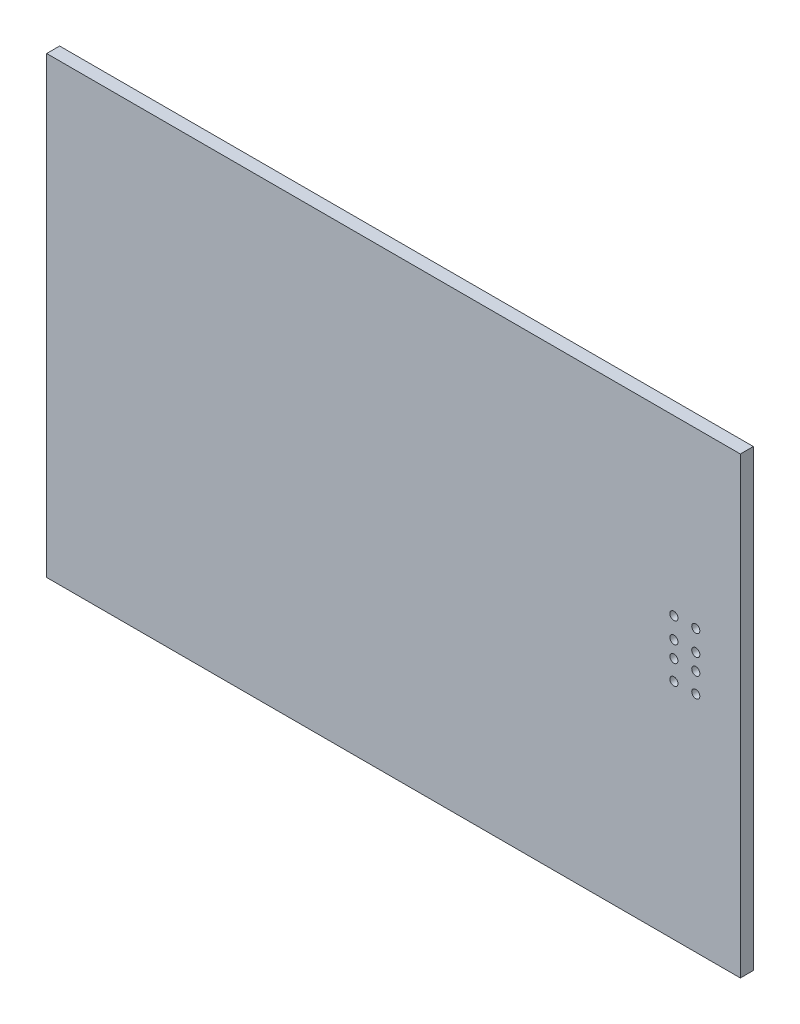
ISO-10303-21;
HEADER;
FILE_DESCRIPTION(('STEP AP214'),'2;1');
FILE_NAME('part.step','',(''),(''),'','','');
FILE_SCHEMA(('AUTOMOTIVE_DESIGN { 1 0 10303 214 1 1 1 1 }'));
ENDSEC;
DATA;
#1=APPLICATION_CONTEXT('core data for automotive mechanical design processes');
#2=APPLICATION_PROTOCOL_DEFINITION('international standard','automotive_design',2000,#1);
#3=PRODUCT_CONTEXT('',#1,'mechanical');
#4=PRODUCT('Part','Part','',(#3));
#5=PRODUCT_RELATED_PRODUCT_CATEGORY('part','',(#4));
#6=PRODUCT_DEFINITION_FORMATION('','',#4);
#7=PRODUCT_DEFINITION_CONTEXT('part definition',#1,'design');
#8=PRODUCT_DEFINITION('design','',#6,#7);
#9=PRODUCT_DEFINITION_SHAPE('','',#8);
#10=(LENGTH_UNIT() NAMED_UNIT(*) SI_UNIT(.MILLI.,.METRE.));
#11=(NAMED_UNIT(*) PLANE_ANGLE_UNIT() SI_UNIT($,.RADIAN.));
#12=(NAMED_UNIT(*) SI_UNIT($,.STERADIAN.) SOLID_ANGLE_UNIT());
#13=UNCERTAINTY_MEASURE_WITH_UNIT(LENGTH_MEASURE(1.E-05),#10,'distance_accuracy_value','');
#14=(GEOMETRIC_REPRESENTATION_CONTEXT(3) GLOBAL_UNCERTAINTY_ASSIGNED_CONTEXT((#13)) GLOBAL_UNIT_ASSIGNED_CONTEXT((#10,
#11,#12)) REPRESENTATION_CONTEXT('',''));
#15=CARTESIAN_POINT('',(0.,0.,0.));
#16=DIRECTION('',(0.,0.,1.));
#17=DIRECTION('',(1.,0.,0.));
#18=AXIS2_PLACEMENT_3D('',#15,#16,#17);
#19=CARTESIAN_POINT('',(-43.1,28.,1.6));
#20=DIRECTION('',(0.,1.,0.));
#21=DIRECTION('',(-1.,0.,0.));
#22=AXIS2_PLACEMENT_3D('',#19,#20,#21);
#23=PLANE('',#22);
#24=DIRECTION('',(1.,0.,0.));
#25=VECTOR('',#24,1.);
#26=CARTESIAN_POINT('',(-43.1,28.,0.));
#27=LINE('',#26,#25);
#28=CARTESIAN_POINT('',(-43.1,28.,0.));
#29=VERTEX_POINT('',#28);
#30=CARTESIAN_POINT('',(42.5,28.,0.));
#31=VERTEX_POINT('',#30);
#32=EDGE_CURVE('E99',#29,#31,#27,.T.);
#33=ORIENTED_EDGE('',*,*,#32,.F.);
#34=DIRECTION('',(0.,0.,-1.));
#35=VECTOR('',#34,1.);
#36=CARTESIAN_POINT('',(-43.1,28.,1.6));
#37=LINE('',#36,#35);
#38=CARTESIAN_POINT('',(-43.1,28.,1.6));
#39=VERTEX_POINT('',#38);
#40=EDGE_CURVE('E11',#39,#29,#37,.T.);
#41=ORIENTED_EDGE('',*,*,#40,.F.);
#42=DIRECTION('',(1.,0.,0.));
#43=VECTOR('',#42,1.);
#44=CARTESIAN_POINT('',(-43.1,28.,1.6));
#45=LINE('',#44,#43);
#46=CARTESIAN_POINT('',(42.5,28.,1.6));
#47=VERTEX_POINT('',#46);
#48=EDGE_CURVE('E92',#39,#47,#45,.T.);
#49=ORIENTED_EDGE('',*,*,#48,.T.);
#50=DIRECTION('',(0.,0.,-1.));
#51=VECTOR('',#50,1.);
#52=CARTESIAN_POINT('',(42.5,28.,1.6));
#53=LINE('',#52,#51);
#54=EDGE_CURVE('E75',#47,#31,#53,.T.);
#55=ORIENTED_EDGE('',*,*,#54,.T.);
#56=EDGE_LOOP('',(#33,#41,#49,#55));
#57=FACE_BOUND('',#56,.T.);
#58=ADVANCED_FACE('F32',(#57),#23,.T.);
#59=CARTESIAN_POINT('',(-43.1,-28.,1.6));
#60=DIRECTION('',(-1.,0.,0.));
#61=DIRECTION('',(0.,-1.,0.));
#62=AXIS2_PLACEMENT_3D('',#59,#60,#61);
#63=PLANE('',#62);
#64=DIRECTION('',(0.,1.,0.));
#65=VECTOR('',#64,1.);
#66=CARTESIAN_POINT('',(-43.1,-28.,0.));
#67=LINE('',#66,#65);
#68=CARTESIAN_POINT('',(-43.1,-28.,0.));
#69=VERTEX_POINT('',#68);
#70=EDGE_CURVE('E94',#69,#29,#67,.T.);
#71=ORIENTED_EDGE('',*,*,#70,.F.);
#72=DIRECTION('',(0.,0.,-1.));
#73=VECTOR('',#72,1.);
#74=CARTESIAN_POINT('',(-43.1,-28.,1.6));
#75=LINE('',#74,#73);
#76=CARTESIAN_POINT('',(-43.1,-28.,1.6));
#77=VERTEX_POINT('',#76);
#78=EDGE_CURVE('E41',#77,#69,#75,.T.);
#79=ORIENTED_EDGE('',*,*,#78,.F.);
#80=DIRECTION('',(0.,1.,0.));
#81=VECTOR('',#80,1.);
#82=CARTESIAN_POINT('',(-43.1,-28.,1.6));
#83=LINE('',#82,#81);
#84=EDGE_CURVE('E89',#77,#39,#83,.T.);
#85=ORIENTED_EDGE('',*,*,#84,.T.);
#86=ORIENTED_EDGE('',*,*,#40,.T.);
#87=EDGE_LOOP('',(#71,#79,#85,#86));
#88=FACE_BOUND('',#87,.T.);
#89=ADVANCED_FACE('F173',(#88),#63,.T.);
#90=CARTESIAN_POINT('',(42.5,-28.,1.6));
#91=DIRECTION('',(0.,-1.,0.));
#92=DIRECTION('',(0.,0.,-1.));
#93=AXIS2_PLACEMENT_3D('',#90,#91,#92);
#94=PLANE('',#93);
#95=DIRECTION('',(-1.,0.,0.));
#96=VECTOR('',#95,1.);
#97=CARTESIAN_POINT('',(42.5,-28.,0.));
#98=LINE('',#97,#96);
#99=CARTESIAN_POINT('',(42.5,-28.,0.));
#100=VERTEX_POINT('',#99);
#101=EDGE_CURVE('E83',#100,#69,#98,.T.);
#102=ORIENTED_EDGE('',*,*,#101,.F.);
#103=DIRECTION('',(0.,0.,-1.));
#104=VECTOR('',#103,1.);
#105=CARTESIAN_POINT('',(42.5,-28.,1.6));
#106=LINE('',#105,#104);
#107=CARTESIAN_POINT('',(42.5,-28.,1.6));
#108=VERTEX_POINT('',#107);
#109=EDGE_CURVE('E78',#108,#100,#106,.T.);
#110=ORIENTED_EDGE('',*,*,#109,.F.);
#111=DIRECTION('',(-1.,0.,0.));
#112=VECTOR('',#111,1.);
#113=CARTESIAN_POINT('',(42.5,-28.,1.6));
#114=LINE('',#113,#112);
#115=EDGE_CURVE('E81',#108,#77,#114,.T.);
#116=ORIENTED_EDGE('',*,*,#115,.T.);
#117=ORIENTED_EDGE('',*,*,#78,.T.);
#118=EDGE_LOOP('',(#102,#110,#116,#117));
#119=FACE_BOUND('',#118,.T.);
#120=ADVANCED_FACE('F80',(#119),#94,.T.);
#121=CARTESIAN_POINT('',(42.5,28.,1.6));
#122=DIRECTION('',(1.,0.,0.));
#123=DIRECTION('',(0.,0.,-1.));
#124=AXIS2_PLACEMENT_3D('',#121,#122,#123);
#125=PLANE('',#124);
#126=DIRECTION('',(0.,-1.,0.));
#127=VECTOR('',#126,1.);
#128=CARTESIAN_POINT('',(42.5,28.,0.));
#129=LINE('',#128,#127);
#130=EDGE_CURVE('E102',#31,#100,#129,.T.);
#131=ORIENTED_EDGE('',*,*,#130,.F.);
#132=ORIENTED_EDGE('',*,*,#54,.F.);
#133=DIRECTION('',(0.,-1.,0.));
#134=VECTOR('',#133,1.);
#135=CARTESIAN_POINT('',(42.5,28.,1.6));
#136=LINE('',#135,#134);
#137=EDGE_CURVE('E88',#47,#108,#136,.T.);
#138=ORIENTED_EDGE('',*,*,#137,.T.);
#139=ORIENTED_EDGE('',*,*,#109,.T.);
#140=EDGE_LOOP('',(#131,#132,#138,#139));
#141=FACE_BOUND('',#140,.T.);
#142=ADVANCED_FACE('F91',(#141),#125,.T.);
#143=CARTESIAN_POINT('',(0.,0.,1.6));
#144=DIRECTION('',(0.,0.,-1.));
#145=DIRECTION('',(-1.,0.,0.));
#146=AXIS2_PLACEMENT_3D('',#143,#144,#145);
#147=PLANE('',#146);
#148=CARTESIAN_POINT('',(37.,-0.4,1.6));
#149=DIRECTION('',(0.,0.,1.));
#150=DIRECTION('',(1.,0.,0.));
#151=AXIS2_PLACEMENT_3D('',#148,#149,#150);
#152=CIRCLE('',#151,0.499999999999999);
#153=CARTESIAN_POINT('',(37.5,-0.4,1.6));
#154=VERTEX_POINT('',#153);
#155=EDGE_CURVE('E144',#154,#154,#152,.T.);
#156=ORIENTED_EDGE('',*,*,#155,.F.);
#157=EDGE_LOOP('',(#156));
#158=FACE_BOUND('',#157,.T.);
#159=CARTESIAN_POINT('',(37.,2.04,1.6));
#160=DIRECTION('',(0.,0.,1.));
#161=DIRECTION('',(1.,0.,0.));
#162=AXIS2_PLACEMENT_3D('',#159,#160,#161);
#163=CIRCLE('',#162,0.499999999999999);
#164=CARTESIAN_POINT('',(37.5,2.04,1.6));
#165=VERTEX_POINT('',#164);
#166=EDGE_CURVE('E134',#165,#165,#163,.T.);
#167=ORIENTED_EDGE('',*,*,#166,.F.);
#168=EDGE_LOOP('',(#167));
#169=FACE_BOUND('',#168,.T.);
#170=CARTESIAN_POINT('',(37.,4.05,1.6));
#171=DIRECTION('',(0.,0.,1.));
#172=DIRECTION('',(1.,0.,0.));
#173=AXIS2_PLACEMENT_3D('',#170,#171,#172);
#174=CIRCLE('',#173,0.499999999999999);
#175=CARTESIAN_POINT('',(37.5,4.05,1.6));
#176=VERTEX_POINT('',#175);
#177=EDGE_CURVE('E131',#176,#176,#174,.T.);
#178=ORIENTED_EDGE('',*,*,#177,.F.);
#179=EDGE_LOOP('',(#178));
#180=FACE_BOUND('',#179,.T.);
#181=CARTESIAN_POINT('',(34.3,-0.4,1.6));
#182=DIRECTION('',(0.,0.,1.));
#183=DIRECTION('',(1.,0.,0.));
#184=AXIS2_PLACEMENT_3D('',#181,#182,#183);
#185=CIRCLE('',#184,0.499999999999999);
#186=CARTESIAN_POINT('',(34.8,-0.4,1.6));
#187=VERTEX_POINT('',#186);
#188=EDGE_CURVE('E128',#187,#187,#185,.T.);
#189=ORIENTED_EDGE('',*,*,#188,.F.);
#190=EDGE_LOOP('',(#189));
#191=FACE_BOUND('',#190,.T.);
#192=CARTESIAN_POINT('',(34.3,2.04,1.6));
#193=DIRECTION('',(0.,0.,1.));
#194=DIRECTION('',(1.,0.,0.));
#195=AXIS2_PLACEMENT_3D('',#192,#193,#194);
#196=CIRCLE('',#195,0.499999999999999);
#197=CARTESIAN_POINT('',(34.8,2.04,1.6));
#198=VERTEX_POINT('',#197);
#199=EDGE_CURVE('E124',#198,#198,#196,.T.);
#200=ORIENTED_EDGE('',*,*,#199,.F.);
#201=EDGE_LOOP('',(#200));
#202=FACE_BOUND('',#201,.T.);
#203=CARTESIAN_POINT('',(34.3,4.05,1.6));
#204=DIRECTION('',(0.,0.,1.));
#205=DIRECTION('',(1.,0.,0.));
#206=AXIS2_PLACEMENT_3D('',#203,#204,#205);
#207=CIRCLE('',#206,0.499999999999999);
#208=CARTESIAN_POINT('',(34.8,4.05,1.6));
#209=VERTEX_POINT('',#208);
#210=EDGE_CURVE('E120',#209,#209,#207,.T.);
#211=ORIENTED_EDGE('',*,*,#210,.F.);
#212=EDGE_LOOP('',(#211));
#213=FACE_BOUND('',#212,.T.);
#214=CARTESIAN_POINT('',(34.3,6.6,1.6));
#215=DIRECTION('',(0.,0.,1.));
#216=DIRECTION('',(1.,0.,0.));
#217=AXIS2_PLACEMENT_3D('',#214,#215,#216);
#218=CIRCLE('',#217,0.499999999999999);
#219=CARTESIAN_POINT('',(34.8,6.6,1.6));
#220=VERTEX_POINT('',#219);
#221=EDGE_CURVE('E116',#220,#220,#218,.T.);
#222=ORIENTED_EDGE('',*,*,#221,.F.);
#223=EDGE_LOOP('',(#222));
#224=FACE_BOUND('',#223,.T.);
#225=CARTESIAN_POINT('',(37.,6.6,1.6));
#226=DIRECTION('',(0.,0.,1.));
#227=DIRECTION('',(1.,0.,0.));
#228=AXIS2_PLACEMENT_3D('',#225,#226,#227);
#229=CIRCLE('',#228,0.499999999999999);
#230=CARTESIAN_POINT('',(37.5,6.6,1.6));
#231=VERTEX_POINT('',#230);
#232=EDGE_CURVE('E112',#231,#231,#229,.T.);
#233=ORIENTED_EDGE('',*,*,#232,.F.);
#234=EDGE_LOOP('',(#233));
#235=FACE_BOUND('',#234,.T.);
#236=ORIENTED_EDGE('',*,*,#48,.F.);
#237=ORIENTED_EDGE('',*,*,#84,.F.);
#238=ORIENTED_EDGE('',*,*,#115,.F.);
#239=ORIENTED_EDGE('',*,*,#137,.F.);
#240=EDGE_LOOP('',(#236,#237,#238,#239));
#241=FACE_BOUND('',#240,.T.);
#242=ADVANCED_FACE('F87',(#158,#169,#180,#191,#202,#213,#224,#235,#241),#147,.F.);
#243=CARTESIAN_POINT('',(0.,0.,0.));
#244=DIRECTION('',(0.,0.,-1.));
#245=DIRECTION('',(-1.,0.,0.));
#246=AXIS2_PLACEMENT_3D('',#243,#244,#245);
#247=PLANE('',#246);
#248=CARTESIAN_POINT('',(37.,-0.4,0.));
#249=DIRECTION('',(0.,0.,-1.));
#250=DIRECTION('',(-1.,0.,0.));
#251=AXIS2_PLACEMENT_3D('',#248,#249,#250);
#252=CIRCLE('',#251,0.499999999999999);
#253=CARTESIAN_POINT('',(36.5,-0.4,0.));
#254=VERTEX_POINT('',#253);
#255=EDGE_CURVE('E35',#254,#254,#252,.T.);
#256=ORIENTED_EDGE('',*,*,#255,.F.);
#257=EDGE_LOOP('',(#256));
#258=FACE_BOUND('',#257,.T.);
#259=CARTESIAN_POINT('',(37.,2.04,0.));
#260=DIRECTION('',(0.,0.,-1.));
#261=DIRECTION('',(-1.,0.,0.));
#262=AXIS2_PLACEMENT_3D('',#259,#260,#261);
#263=CIRCLE('',#262,0.499999999999999);
#264=CARTESIAN_POINT('',(36.5,2.04,0.));
#265=VERTEX_POINT('',#264);
#266=EDGE_CURVE('E132',#265,#265,#263,.T.);
#267=ORIENTED_EDGE('',*,*,#266,.F.);
#268=EDGE_LOOP('',(#267));
#269=FACE_BOUND('',#268,.T.);
#270=CARTESIAN_POINT('',(37.,4.05,0.));
#271=DIRECTION('',(0.,0.,-1.));
#272=DIRECTION('',(-1.,0.,0.));
#273=AXIS2_PLACEMENT_3D('',#270,#271,#272);
#274=CIRCLE('',#273,0.499999999999999);
#275=CARTESIAN_POINT('',(36.5,4.05,0.));
#276=VERTEX_POINT('',#275);
#277=EDGE_CURVE('E129',#276,#276,#274,.T.);
#278=ORIENTED_EDGE('',*,*,#277,.F.);
#279=EDGE_LOOP('',(#278));
#280=FACE_BOUND('',#279,.T.);
#281=CARTESIAN_POINT('',(34.3,-0.4,0.));
#282=DIRECTION('',(0.,0.,-1.));
#283=DIRECTION('',(-1.,0.,0.));
#284=AXIS2_PLACEMENT_3D('',#281,#282,#283);
#285=CIRCLE('',#284,0.499999999999999);
#286=CARTESIAN_POINT('',(33.8,-0.4,0.));
#287=VERTEX_POINT('',#286);
#288=EDGE_CURVE('E125',#287,#287,#285,.T.);
#289=ORIENTED_EDGE('',*,*,#288,.F.);
#290=EDGE_LOOP('',(#289));
#291=FACE_BOUND('',#290,.T.);
#292=CARTESIAN_POINT('',(34.3,2.04,0.));
#293=DIRECTION('',(0.,0.,-1.));
#294=DIRECTION('',(-1.,0.,0.));
#295=AXIS2_PLACEMENT_3D('',#292,#293,#294);
#296=CIRCLE('',#295,0.499999999999999);
#297=CARTESIAN_POINT('',(33.8,2.04,0.));
#298=VERTEX_POINT('',#297);
#299=EDGE_CURVE('E121',#298,#298,#296,.T.);
#300=ORIENTED_EDGE('',*,*,#299,.F.);
#301=EDGE_LOOP('',(#300));
#302=FACE_BOUND('',#301,.T.);
#303=CARTESIAN_POINT('',(34.3,4.05,0.));
#304=DIRECTION('',(0.,0.,-1.));
#305=DIRECTION('',(-1.,0.,0.));
#306=AXIS2_PLACEMENT_3D('',#303,#304,#305);
#307=CIRCLE('',#306,0.499999999999999);
#308=CARTESIAN_POINT('',(33.8,4.05,0.));
#309=VERTEX_POINT('',#308);
#310=EDGE_CURVE('E117',#309,#309,#307,.T.);
#311=ORIENTED_EDGE('',*,*,#310,.F.);
#312=EDGE_LOOP('',(#311));
#313=FACE_BOUND('',#312,.T.);
#314=CARTESIAN_POINT('',(34.3,6.6,0.));
#315=DIRECTION('',(0.,0.,-1.));
#316=DIRECTION('',(-1.,0.,0.));
#317=AXIS2_PLACEMENT_3D('',#314,#315,#316);
#318=CIRCLE('',#317,0.499999999999999);
#319=CARTESIAN_POINT('',(33.8,6.6,0.));
#320=VERTEX_POINT('',#319);
#321=EDGE_CURVE('E113',#320,#320,#318,.T.);
#322=ORIENTED_EDGE('',*,*,#321,.F.);
#323=EDGE_LOOP('',(#322));
#324=FACE_BOUND('',#323,.T.);
#325=CARTESIAN_POINT('',(37.,6.6,0.));
#326=DIRECTION('',(0.,0.,-1.));
#327=DIRECTION('',(-1.,0.,0.));
#328=AXIS2_PLACEMENT_3D('',#325,#326,#327);
#329=CIRCLE('',#328,0.499999999999999);
#330=CARTESIAN_POINT('',(36.5,6.6,0.));
#331=VERTEX_POINT('',#330);
#332=EDGE_CURVE('E103',#331,#331,#329,.T.);
#333=ORIENTED_EDGE('',*,*,#332,.F.);
#334=EDGE_LOOP('',(#333));
#335=FACE_BOUND('',#334,.T.);
#336=ORIENTED_EDGE('',*,*,#32,.T.);
#337=ORIENTED_EDGE('',*,*,#130,.T.);
#338=ORIENTED_EDGE('',*,*,#101,.T.);
#339=ORIENTED_EDGE('',*,*,#70,.T.);
#340=EDGE_LOOP('',(#336,#337,#338,#339));
#341=FACE_BOUND('',#340,.T.);
#342=ADVANCED_FACE('F160',(#258,#269,#280,#291,#302,#313,#324,#335,#341),#247,.T.);
#343=CARTESIAN_POINT('',(37.,6.6,-0.4));
#344=DIRECTION('',(0.,0.,1.));
#345=DIRECTION('',(1.,0.,0.));
#346=AXIS2_PLACEMENT_3D('',#343,#344,#345);
#347=CYLINDRICAL_SURFACE('',#346,0.499999999999999);
#348=ORIENTED_EDGE('',*,*,#332,.T.);
#349=EDGE_LOOP('',(#348));
#350=FACE_BOUND('',#349,.T.);
#351=ORIENTED_EDGE('',*,*,#232,.T.);
#352=EDGE_LOOP('',(#351));
#353=FACE_BOUND('',#352,.T.);
#354=ADVANCED_FACE('F157',(#350,#353),#347,.F.);
#355=CARTESIAN_POINT('',(34.3,6.6,-0.4));
#356=DIRECTION('',(0.,0.,1.));
#357=DIRECTION('',(1.,0.,0.));
#358=AXIS2_PLACEMENT_3D('',#355,#356,#357);
#359=CYLINDRICAL_SURFACE('',#358,0.499999999999999);
#360=ORIENTED_EDGE('',*,*,#321,.T.);
#361=EDGE_LOOP('',(#360));
#362=FACE_BOUND('',#361,.T.);
#363=ORIENTED_EDGE('',*,*,#221,.T.);
#364=EDGE_LOOP('',(#363));
#365=FACE_BOUND('',#364,.T.);
#366=ADVANCED_FACE('F208',(#362,#365),#359,.F.);
#367=CARTESIAN_POINT('',(34.3,4.05,-0.4));
#368=DIRECTION('',(0.,0.,1.));
#369=DIRECTION('',(1.,0.,0.));
#370=AXIS2_PLACEMENT_3D('',#367,#368,#369);
#371=CYLINDRICAL_SURFACE('',#370,0.499999999999999);
#372=ORIENTED_EDGE('',*,*,#310,.T.);
#373=EDGE_LOOP('',(#372));
#374=FACE_BOUND('',#373,.T.);
#375=ORIENTED_EDGE('',*,*,#210,.T.);
#376=EDGE_LOOP('',(#375));
#377=FACE_BOUND('',#376,.T.);
#378=ADVANCED_FACE('F217',(#374,#377),#371,.F.);
#379=CARTESIAN_POINT('',(34.3,2.04,-0.4));
#380=DIRECTION('',(0.,0.,1.));
#381=DIRECTION('',(1.,0.,0.));
#382=AXIS2_PLACEMENT_3D('',#379,#380,#381);
#383=CYLINDRICAL_SURFACE('',#382,0.499999999999999);
#384=ORIENTED_EDGE('',*,*,#299,.T.);
#385=EDGE_LOOP('',(#384));
#386=FACE_BOUND('',#385,.T.);
#387=ORIENTED_EDGE('',*,*,#199,.T.);
#388=EDGE_LOOP('',(#387));
#389=FACE_BOUND('',#388,.T.);
#390=ADVANCED_FACE('F227',(#386,#389),#383,.F.);
#391=CARTESIAN_POINT('',(34.3,-0.4,-0.4));
#392=DIRECTION('',(0.,0.,1.));
#393=DIRECTION('',(1.,0.,0.));
#394=AXIS2_PLACEMENT_3D('',#391,#392,#393);
#395=CYLINDRICAL_SURFACE('',#394,0.499999999999999);
#396=ORIENTED_EDGE('',*,*,#288,.T.);
#397=EDGE_LOOP('',(#396));
#398=FACE_BOUND('',#397,.T.);
#399=ORIENTED_EDGE('',*,*,#188,.T.);
#400=EDGE_LOOP('',(#399));
#401=FACE_BOUND('',#400,.T.);
#402=ADVANCED_FACE('F237',(#398,#401),#395,.F.);
#403=CARTESIAN_POINT('',(37.,4.05,-0.4));
#404=DIRECTION('',(0.,0.,1.));
#405=DIRECTION('',(1.,0.,0.));
#406=AXIS2_PLACEMENT_3D('',#403,#404,#405);
#407=CYLINDRICAL_SURFACE('',#406,0.499999999999999);
#408=ORIENTED_EDGE('',*,*,#277,.T.);
#409=EDGE_LOOP('',(#408));
#410=FACE_BOUND('',#409,.T.);
#411=ORIENTED_EDGE('',*,*,#177,.T.);
#412=EDGE_LOOP('',(#411));
#413=FACE_BOUND('',#412,.T.);
#414=ADVANCED_FACE('F247',(#410,#413),#407,.F.);
#415=CARTESIAN_POINT('',(37.,2.04,-0.4));
#416=DIRECTION('',(0.,0.,1.));
#417=DIRECTION('',(1.,0.,0.));
#418=AXIS2_PLACEMENT_3D('',#415,#416,#417);
#419=CYLINDRICAL_SURFACE('',#418,0.499999999999999);
#420=ORIENTED_EDGE('',*,*,#266,.T.);
#421=EDGE_LOOP('',(#420));
#422=FACE_BOUND('',#421,.T.);
#423=ORIENTED_EDGE('',*,*,#166,.T.);
#424=EDGE_LOOP('',(#423));
#425=FACE_BOUND('',#424,.T.);
#426=ADVANCED_FACE('F257',(#422,#425),#419,.F.);
#427=CARTESIAN_POINT('',(37.,-0.4,-0.4));
#428=DIRECTION('',(0.,0.,1.));
#429=DIRECTION('',(1.,0.,0.));
#430=AXIS2_PLACEMENT_3D('',#427,#428,#429);
#431=CYLINDRICAL_SURFACE('',#430,0.499999999999999);
#432=ORIENTED_EDGE('',*,*,#255,.T.);
#433=EDGE_LOOP('',(#432));
#434=FACE_BOUND('',#433,.T.);
#435=ORIENTED_EDGE('',*,*,#155,.T.);
#436=EDGE_LOOP('',(#435));
#437=FACE_BOUND('',#436,.T.);
#438=ADVANCED_FACE('F267',(#434,#437),#431,.F.);
#439=CLOSED_SHELL('',(#58,#89,#120,#142,#242,#342,#354,#366,#378,#390,#402,#414,#426,#438));
#440=MANIFOLD_SOLID_BREP('B2',#439);
#441=ADVANCED_BREP_SHAPE_REPRESENTATION('',(#18,#440),#14);
#442=SHAPE_DEFINITION_REPRESENTATION(#9,#441);
ENDSEC;
END-ISO-10303-21;
